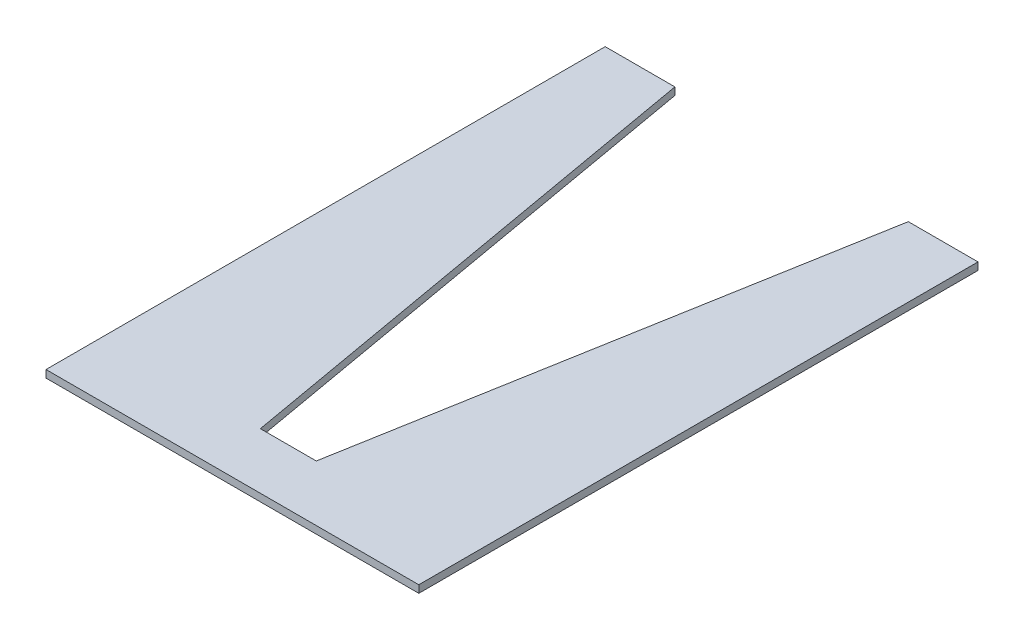
ISO-10303-21;
HEADER;
FILE_DESCRIPTION(('STEP AP214'),'2;1');
FILE_NAME('part.step','',(''),(''),'','','');
FILE_SCHEMA(('AUTOMOTIVE_DESIGN { 1 0 10303 214 1 1 1 1 }'));
ENDSEC;
DATA;
#1=APPLICATION_CONTEXT('core data for automotive mechanical design processes');
#2=APPLICATION_PROTOCOL_DEFINITION('international standard','automotive_design',2000,#1);
#3=PRODUCT_CONTEXT('',#1,'mechanical');
#4=PRODUCT('Part','Part','',(#3));
#5=PRODUCT_RELATED_PRODUCT_CATEGORY('part','',(#4));
#6=PRODUCT_DEFINITION_FORMATION('','',#4);
#7=PRODUCT_DEFINITION_CONTEXT('part definition',#1,'design');
#8=PRODUCT_DEFINITION('design','',#6,#7);
#9=PRODUCT_DEFINITION_SHAPE('','',#8);
#10=(LENGTH_UNIT() NAMED_UNIT(*) SI_UNIT(.MILLI.,.METRE.));
#11=(NAMED_UNIT(*) PLANE_ANGLE_UNIT() SI_UNIT($,.RADIAN.));
#12=(NAMED_UNIT(*) SI_UNIT($,.STERADIAN.) SOLID_ANGLE_UNIT());
#13=UNCERTAINTY_MEASURE_WITH_UNIT(LENGTH_MEASURE(1.E-05),#10,'distance_accuracy_value','');
#14=(GEOMETRIC_REPRESENTATION_CONTEXT(3) GLOBAL_UNCERTAINTY_ASSIGNED_CONTEXT((#13)) GLOBAL_UNIT_ASSIGNED_CONTEXT((#10,
#11,#12)) REPRESENTATION_CONTEXT('',''));
#15=CARTESIAN_POINT('',(0.,0.,0.));
#16=DIRECTION('',(0.,0.,1.));
#17=DIRECTION('',(1.,0.,0.));
#18=AXIS2_PLACEMENT_3D('',#15,#16,#17);
#19=CARTESIAN_POINT('',(15.,4.,-22.4393199928616));
#20=DIRECTION('',(0.,0.,1.));
#21=DIRECTION('',(1.,0.,0.));
#22=AXIS2_PLACEMENT_3D('',#19,#20,#21);
#23=PLANE('',#22);
#24=DIRECTION('',(-1.,0.,0.));
#25=VECTOR('',#24,1.);
#26=CARTESIAN_POINT('',(15.,0.,-22.4393199928616));
#27=LINE('',#26,#25);
#28=CARTESIAN_POINT('',(15.,0.,-22.4393199928616));
#29=VERTEX_POINT('',#28);
#30=CARTESIAN_POINT('',(-15.,0.,-22.4393199928616));
#31=VERTEX_POINT('',#30);
#32=EDGE_CURVE('E129',#29,#31,#27,.T.);
#33=ORIENTED_EDGE('',*,*,#32,.T.);
#34=DIRECTION('',(0.,-1.,0.));
#35=VECTOR('',#34,1.);
#36=CARTESIAN_POINT('',(-15.,4.,-22.4393199928616));
#37=LINE('',#36,#35);
#38=CARTESIAN_POINT('',(-15.,4.,-22.4393199928616));
#39=VERTEX_POINT('',#38);
#40=EDGE_CURVE('E11',#39,#31,#37,.T.);
#41=ORIENTED_EDGE('',*,*,#40,.F.);
#42=DIRECTION('',(-1.,0.,0.));
#43=VECTOR('',#42,1.);
#44=CARTESIAN_POINT('',(15.,4.,-22.4393199928616));
#45=LINE('',#44,#43);
#46=CARTESIAN_POINT('',(15.,4.,-22.4393199928616));
#47=VERTEX_POINT('',#46);
#48=EDGE_CURVE('E143',#47,#39,#45,.T.);
#49=ORIENTED_EDGE('',*,*,#48,.F.);
#50=DIRECTION('',(0.,-1.,0.));
#51=VECTOR('',#50,1.);
#52=CARTESIAN_POINT('',(15.,4.,-22.4393199928616));
#53=LINE('',#52,#51);
#54=EDGE_CURVE('E125',#47,#29,#53,.T.);
#55=ORIENTED_EDGE('',*,*,#54,.T.);
#56=EDGE_LOOP('',(#33,#41,#49,#55));
#57=FACE_BOUND('',#56,.T.);
#58=ADVANCED_FACE('F33',(#57),#23,.F.);
#59=CARTESIAN_POINT('',(-15.,4.,-22.4393199928616));
#60=DIRECTION('',(-0.984807753012208,0.,0.173648177666931));
#61=DIRECTION('',(0.173648177666931,0.,0.984807753012208));
#62=AXIS2_PLACEMENT_3D('',#59,#60,#61);
#63=PLANE('',#62);
#64=DIRECTION('',(-0.173648177666931,0.,-0.984807753012208));
#65=VECTOR('',#64,1.);
#66=CARTESIAN_POINT('',(-15.,0.,-22.4393199928616));
#67=LINE('',#66,#65);
#68=CARTESIAN_POINT('',(-62.6082847912857,0.,-292.439319992862));
#69=VERTEX_POINT('',#68);
#70=EDGE_CURVE('E132',#31,#69,#67,.T.);
#71=ORIENTED_EDGE('',*,*,#70,.T.);
#72=DIRECTION('',(0.,-1.,0.));
#73=VECTOR('',#72,1.);
#74=CARTESIAN_POINT('',(-62.6082847912857,4.,-292.439319992862));
#75=LINE('',#74,#73);
#76=CARTESIAN_POINT('',(-62.6082847912857,4.,-292.439319992862));
#77=VERTEX_POINT('',#76);
#78=EDGE_CURVE('E41',#77,#69,#75,.T.);
#79=ORIENTED_EDGE('',*,*,#78,.F.);
#80=DIRECTION('',(-0.173648177666931,0.,-0.984807753012208));
#81=VECTOR('',#80,1.);
#82=CARTESIAN_POINT('',(-15.,4.,-22.4393199928616));
#83=LINE('',#82,#81);
#84=EDGE_CURVE('E92',#39,#77,#83,.T.);
#85=ORIENTED_EDGE('',*,*,#84,.F.);
#86=ORIENTED_EDGE('',*,*,#40,.T.);
#87=EDGE_LOOP('',(#71,#79,#85,#86));
#88=FACE_BOUND('',#87,.T.);
#89=ADVANCED_FACE('F178',(#88),#63,.F.);
#90=CARTESIAN_POINT('',(-62.6082847912857,4.,-292.439319992862));
#91=DIRECTION('',(0.,0.,1.));
#92=DIRECTION('',(1.,0.,0.));
#93=AXIS2_PLACEMENT_3D('',#90,#91,#92);
#94=PLANE('',#93);
#95=DIRECTION('',(-1.,0.,0.));
#96=VECTOR('',#95,1.);
#97=CARTESIAN_POINT('',(-62.6082847912857,0.,-292.439319992862));
#98=LINE('',#97,#96);
#99=CARTESIAN_POINT('',(-100.,0.,-292.439319992862));
#100=VERTEX_POINT('',#99);
#101=EDGE_CURVE('E134',#69,#100,#98,.T.);
#102=ORIENTED_EDGE('',*,*,#101,.T.);
#103=DIRECTION('',(0.,-1.,0.));
#104=VECTOR('',#103,1.);
#105=CARTESIAN_POINT('',(-100.,4.,-292.439319992862));
#106=LINE('',#105,#104);
#107=CARTESIAN_POINT('',(-100.,4.,-292.439319992862));
#108=VERTEX_POINT('',#107);
#109=EDGE_CURVE('E150',#108,#100,#106,.T.);
#110=ORIENTED_EDGE('',*,*,#109,.F.);
#111=DIRECTION('',(-1.,0.,0.));
#112=VECTOR('',#111,1.);
#113=CARTESIAN_POINT('',(-62.6082847912857,4.,-292.439319992862));
#114=LINE('',#113,#112);
#115=EDGE_CURVE('E158',#77,#108,#114,.T.);
#116=ORIENTED_EDGE('',*,*,#115,.F.);
#117=ORIENTED_EDGE('',*,*,#78,.T.);
#118=EDGE_LOOP('',(#102,#110,#116,#117));
#119=FACE_BOUND('',#118,.T.);
#120=ADVANCED_FACE('F156',(#119),#94,.F.);
#121=CARTESIAN_POINT('',(-100.,4.,-292.439319992862));
#122=DIRECTION('',(1.,0.,0.));
#123=DIRECTION('',(0.,0.,-1.));
#124=AXIS2_PLACEMENT_3D('',#121,#122,#123);
#125=PLANE('',#124);
#126=DIRECTION('',(0.,0.,1.));
#127=VECTOR('',#126,1.);
#128=CARTESIAN_POINT('',(-100.,0.,-292.439319992862));
#129=LINE('',#128,#127);
#130=CARTESIAN_POINT('',(-100.,0.,7.56068000713844));
#131=VERTEX_POINT('',#130);
#132=EDGE_CURVE('E136',#100,#131,#129,.T.);
#133=ORIENTED_EDGE('',*,*,#132,.T.);
#134=DIRECTION('',(0.,-1.,0.));
#135=VECTOR('',#134,1.);
#136=CARTESIAN_POINT('',(-100.,4.,7.56068000713844));
#137=LINE('',#136,#135);
#138=CARTESIAN_POINT('',(-100.,4.,7.56068000713844));
#139=VERTEX_POINT('',#138);
#140=EDGE_CURVE('E147',#139,#131,#137,.T.);
#141=ORIENTED_EDGE('',*,*,#140,.F.);
#142=DIRECTION('',(0.,0.,1.));
#143=VECTOR('',#142,1.);
#144=CARTESIAN_POINT('',(-100.,4.,-292.439319992862));
#145=LINE('',#144,#143);
#146=EDGE_CURVE('E170',#108,#139,#145,.T.);
#147=ORIENTED_EDGE('',*,*,#146,.F.);
#148=ORIENTED_EDGE('',*,*,#109,.T.);
#149=EDGE_LOOP('',(#133,#141,#147,#148));
#150=FACE_BOUND('',#149,.T.);
#151=ADVANCED_FACE('F166',(#150),#125,.F.);
#152=CARTESIAN_POINT('',(-100.,4.,7.56068000713844));
#153=DIRECTION('',(0.,0.,-1.));
#154=DIRECTION('',(-1.,0.,0.));
#155=AXIS2_PLACEMENT_3D('',#152,#153,#154);
#156=PLANE('',#155);
#157=DIRECTION('',(1.,0.,0.));
#158=VECTOR('',#157,1.);
#159=CARTESIAN_POINT('',(-100.,0.,7.56068000713844));
#160=LINE('',#159,#158);
#161=CARTESIAN_POINT('',(100.,0.,7.56068000713842));
#162=VERTEX_POINT('',#161);
#163=EDGE_CURVE('E138',#131,#162,#160,.T.);
#164=ORIENTED_EDGE('',*,*,#163,.T.);
#165=DIRECTION('',(0.,-1.,0.));
#166=VECTOR('',#165,1.);
#167=CARTESIAN_POINT('',(100.,4.,7.56068000713842));
#168=LINE('',#167,#166);
#169=CARTESIAN_POINT('',(100.,4.,7.56068000713842));
#170=VERTEX_POINT('',#169);
#171=EDGE_CURVE('E120',#170,#162,#168,.T.);
#172=ORIENTED_EDGE('',*,*,#171,.F.);
#173=DIRECTION('',(1.,0.,0.));
#174=VECTOR('',#173,1.);
#175=CARTESIAN_POINT('',(-100.,4.,7.56068000713844));
#176=LINE('',#175,#174);
#177=EDGE_CURVE('E111',#139,#170,#176,.T.);
#178=ORIENTED_EDGE('',*,*,#177,.F.);
#179=ORIENTED_EDGE('',*,*,#140,.T.);
#180=EDGE_LOOP('',(#164,#172,#178,#179));
#181=FACE_BOUND('',#180,.T.);
#182=ADVANCED_FACE('F169',(#181),#156,.F.);
#183=CARTESIAN_POINT('',(100.,4.,7.56068000713842));
#184=DIRECTION('',(-1.,0.,0.));
#185=DIRECTION('',(0.,0.,1.));
#186=AXIS2_PLACEMENT_3D('',#183,#184,#185);
#187=PLANE('',#186);
#188=DIRECTION('',(0.,0.,-1.));
#189=VECTOR('',#188,1.);
#190=CARTESIAN_POINT('',(100.,0.,7.56068000713842));
#191=LINE('',#190,#189);
#192=CARTESIAN_POINT('',(100.,0.,-292.439319992862));
#193=VERTEX_POINT('',#192);
#194=EDGE_CURVE('E119',#162,#193,#191,.T.);
#195=ORIENTED_EDGE('',*,*,#194,.T.);
#196=DIRECTION('',(0.,-1.,0.));
#197=VECTOR('',#196,1.);
#198=CARTESIAN_POINT('',(100.,4.,-292.439319992862));
#199=LINE('',#198,#197);
#200=CARTESIAN_POINT('',(100.,4.,-292.439319992862));
#201=VERTEX_POINT('',#200);
#202=EDGE_CURVE('E116',#201,#193,#199,.T.);
#203=ORIENTED_EDGE('',*,*,#202,.F.);
#204=DIRECTION('',(0.,0.,-1.));
#205=VECTOR('',#204,1.);
#206=CARTESIAN_POINT('',(100.,4.,7.56068000713842));
#207=LINE('',#206,#205);
#208=EDGE_CURVE('E105',#170,#201,#207,.T.);
#209=ORIENTED_EDGE('',*,*,#208,.F.);
#210=ORIENTED_EDGE('',*,*,#171,.T.);
#211=EDGE_LOOP('',(#195,#203,#209,#210));
#212=FACE_BOUND('',#211,.T.);
#213=ADVANCED_FACE('F117',(#212),#187,.F.);
#214=CARTESIAN_POINT('',(100.,4.,-292.439319992862));
#215=DIRECTION('',(0.,0.,1.));
#216=DIRECTION('',(1.,0.,0.));
#217=AXIS2_PLACEMENT_3D('',#214,#215,#216);
#218=PLANE('',#217);
#219=DIRECTION('',(-1.,0.,0.));
#220=VECTOR('',#219,1.);
#221=CARTESIAN_POINT('',(100.,0.,-292.439319992862));
#222=LINE('',#221,#220);
#223=CARTESIAN_POINT('',(62.6082847912856,0.,-292.439319992862));
#224=VERTEX_POINT('',#223);
#225=EDGE_CURVE('E78',#193,#224,#222,.T.);
#226=ORIENTED_EDGE('',*,*,#225,.T.);
#227=DIRECTION('',(0.,-1.,0.));
#228=VECTOR('',#227,1.);
#229=CARTESIAN_POINT('',(62.6082847912856,4.,-292.439319992862));
#230=LINE('',#229,#228);
#231=CARTESIAN_POINT('',(62.6082847912856,4.,-292.439319992862));
#232=VERTEX_POINT('',#231);
#233=EDGE_CURVE('E121',#232,#224,#230,.T.);
#234=ORIENTED_EDGE('',*,*,#233,.F.);
#235=DIRECTION('',(-1.,0.,0.));
#236=VECTOR('',#235,1.);
#237=CARTESIAN_POINT('',(100.,4.,-292.439319992862));
#238=LINE('',#237,#236);
#239=EDGE_CURVE('E109',#201,#232,#238,.T.);
#240=ORIENTED_EDGE('',*,*,#239,.F.);
#241=ORIENTED_EDGE('',*,*,#202,.T.);
#242=EDGE_LOOP('',(#226,#234,#240,#241));
#243=FACE_BOUND('',#242,.T.);
#244=ADVANCED_FACE('F123',(#243),#218,.F.);
#245=CARTESIAN_POINT('',(62.6082847912856,4.,-292.439319992862));
#246=DIRECTION('',(0.984807753012208,0.,0.173648177666931));
#247=DIRECTION('',(0.173648177666931,0.,-0.984807753012208));
#248=AXIS2_PLACEMENT_3D('',#245,#246,#247);
#249=PLANE('',#248);
#250=DIRECTION('',(-0.173648177666931,0.,0.984807753012208));
#251=VECTOR('',#250,1.);
#252=CARTESIAN_POINT('',(62.6082847912856,0.,-292.439319992862));
#253=LINE('',#252,#251);
#254=EDGE_CURVE('E84',#224,#29,#253,.T.);
#255=ORIENTED_EDGE('',*,*,#254,.T.);
#256=ORIENTED_EDGE('',*,*,#54,.F.);
#257=DIRECTION('',(-0.173648177666931,0.,0.984807753012208));
#258=VECTOR('',#257,1.);
#259=CARTESIAN_POINT('',(62.6082847912856,4.,-292.439319992862));
#260=LINE('',#259,#258);
#261=EDGE_CURVE('E49',#232,#47,#260,.T.);
#262=ORIENTED_EDGE('',*,*,#261,.F.);
#263=ORIENTED_EDGE('',*,*,#233,.T.);
#264=EDGE_LOOP('',(#255,#256,#262,#263));
#265=FACE_BOUND('',#264,.T.);
#266=ADVANCED_FACE('F194',(#265),#249,.F.);
#267=CARTESIAN_POINT('',(0.,4.,0.));
#268=DIRECTION('',(0.,1.,0.));
#269=DIRECTION('',(0.,0.,1.));
#270=AXIS2_PLACEMENT_3D('',#267,#268,#269);
#271=PLANE('',#270);
#272=ORIENTED_EDGE('',*,*,#48,.T.);
#273=ORIENTED_EDGE('',*,*,#84,.T.);
#274=ORIENTED_EDGE('',*,*,#115,.T.);
#275=ORIENTED_EDGE('',*,*,#146,.T.);
#276=ORIENTED_EDGE('',*,*,#177,.T.);
#277=ORIENTED_EDGE('',*,*,#208,.T.);
#278=ORIENTED_EDGE('',*,*,#239,.T.);
#279=ORIENTED_EDGE('',*,*,#261,.T.);
#280=EDGE_LOOP('',(#272,#273,#274,#275,#276,#277,#278,#279));
#281=FACE_BOUND('',#280,.T.);
#282=ADVANCED_FACE('F107',(#281),#271,.T.);
#283=CARTESIAN_POINT('',(0.,0.,0.));
#284=DIRECTION('',(0.,1.,0.));
#285=DIRECTION('',(0.,0.,1.));
#286=AXIS2_PLACEMENT_3D('',#283,#284,#285);
#287=PLANE('',#286);
#288=ORIENTED_EDGE('',*,*,#32,.F.);
#289=ORIENTED_EDGE('',*,*,#254,.F.);
#290=ORIENTED_EDGE('',*,*,#225,.F.);
#291=ORIENTED_EDGE('',*,*,#194,.F.);
#292=ORIENTED_EDGE('',*,*,#163,.F.);
#293=ORIENTED_EDGE('',*,*,#132,.F.);
#294=ORIENTED_EDGE('',*,*,#101,.F.);
#295=ORIENTED_EDGE('',*,*,#70,.F.);
#296=EDGE_LOOP('',(#288,#289,#290,#291,#292,#293,#294,#295));
#297=FACE_BOUND('',#296,.T.);
#298=ADVANCED_FACE('F162',(#297),#287,.F.);
#299=CLOSED_SHELL('',(#58,#89,#120,#151,#182,#213,#244,#266,#282,#298));
#300=MANIFOLD_SOLID_BREP('B2',#299);
#301=ADVANCED_BREP_SHAPE_REPRESENTATION('',(#18,#300),#14);
#302=SHAPE_DEFINITION_REPRESENTATION(#9,#301);
ENDSEC;
END-ISO-10303-21;
